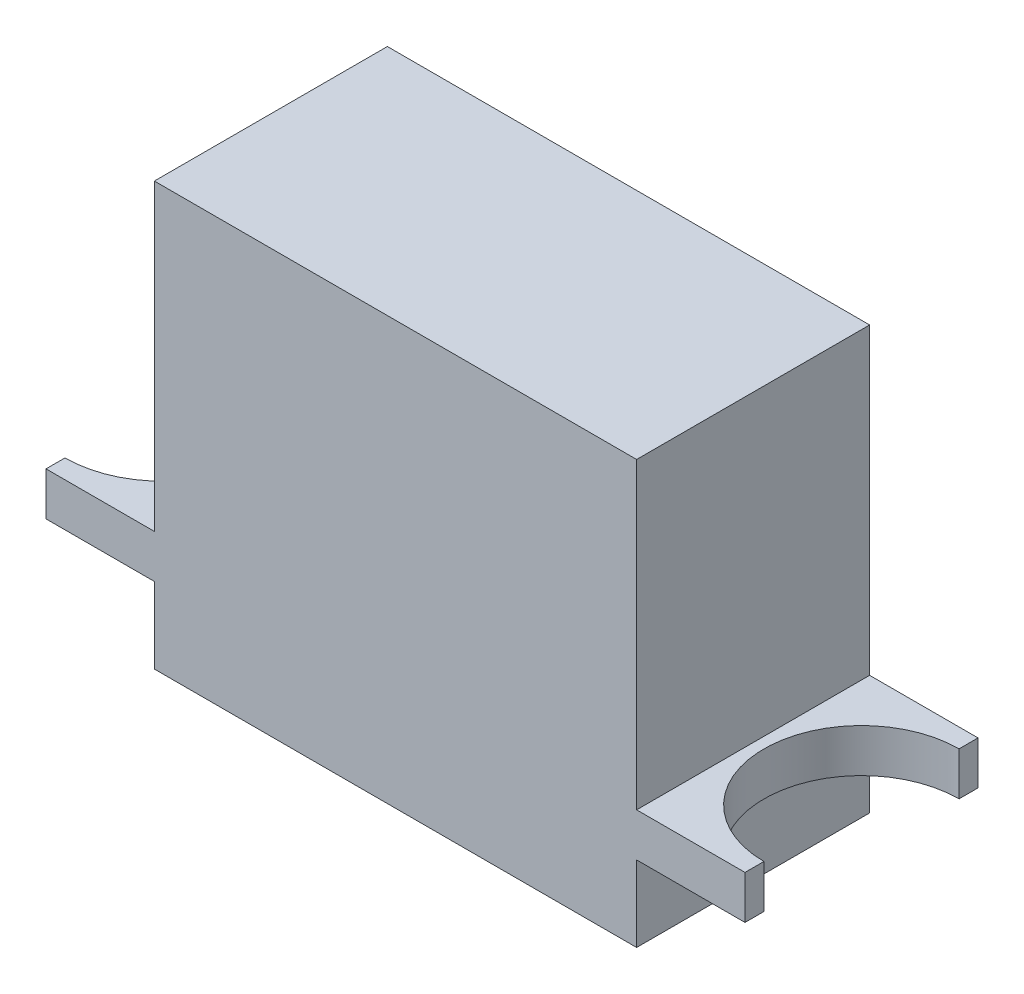
ISO-10303-21;
HEADER;
FILE_DESCRIPTION(('STEP AP214'),'2;1');
FILE_NAME('part.step','',(''),(''),'','','');
FILE_SCHEMA(('AUTOMOTIVE_DESIGN { 1 0 10303 214 1 1 1 1 }'));
ENDSEC;
DATA;
#1=APPLICATION_CONTEXT('core data for automotive mechanical design processes');
#2=APPLICATION_PROTOCOL_DEFINITION('international standard','automotive_design',2000,#1);
#3=PRODUCT_CONTEXT('',#1,'mechanical');
#4=PRODUCT('Part','Part','',(#3));
#5=PRODUCT_RELATED_PRODUCT_CATEGORY('part','',(#4));
#6=PRODUCT_DEFINITION_FORMATION('','',#4);
#7=PRODUCT_DEFINITION_CONTEXT('part definition',#1,'design');
#8=PRODUCT_DEFINITION('design','',#6,#7);
#9=PRODUCT_DEFINITION_SHAPE('','',#8);
#10=(LENGTH_UNIT() NAMED_UNIT(*) SI_UNIT(.MILLI.,.METRE.));
#11=(NAMED_UNIT(*) PLANE_ANGLE_UNIT() SI_UNIT($,.RADIAN.));
#12=(NAMED_UNIT(*) SI_UNIT($,.STERADIAN.) SOLID_ANGLE_UNIT());
#13=UNCERTAINTY_MEASURE_WITH_UNIT(LENGTH_MEASURE(1.E-05),#10,'distance_accuracy_value','');
#14=(GEOMETRIC_REPRESENTATION_CONTEXT(3) GLOBAL_UNCERTAINTY_ASSIGNED_CONTEXT((#13)) GLOBAL_UNIT_ASSIGNED_CONTEXT((#10,
#11,#12)) REPRESENTATION_CONTEXT('',''));
#15=CARTESIAN_POINT('',(0.,0.,0.));
#16=DIRECTION('',(0.,0.,1.));
#17=DIRECTION('',(1.,0.,0.));
#18=AXIS2_PLACEMENT_3D('',#15,#16,#17);
#19=CARTESIAN_POINT('',(-11.125,19.5,5.375));
#20=DIRECTION('',(-1.,0.,0.));
#21=DIRECTION('',(0.,0.,1.));
#22=AXIS2_PLACEMENT_3D('',#19,#20,#21);
#23=PLANE('',#22);
#24=DIRECTION('',(0.,-1.,0.));
#25=VECTOR('',#24,1.);
#26=CARTESIAN_POINT('',(-11.125,19.5,5.375));
#27=LINE('',#26,#25);
#28=CARTESIAN_POINT('',(-11.125,3.5,5.375));
#29=VERTEX_POINT('',#28);
#30=CARTESIAN_POINT('',(-11.125,0.,5.375));
#31=VERTEX_POINT('',#30);
#32=EDGE_CURVE('E48',#29,#31,#27,.T.);
#33=ORIENTED_EDGE('',*,*,#32,.F.);
#34=DIRECTION('',(0.,0.,-1.));
#35=VECTOR('',#34,1.);
#36=CARTESIAN_POINT('',(-11.125,3.5,5.375));
#37=LINE('',#36,#35);
#38=CARTESIAN_POINT('',(-11.125,3.5,-5.375));
#39=VERTEX_POINT('',#38);
#40=EDGE_CURVE('E230',#29,#39,#37,.T.);
#41=ORIENTED_EDGE('',*,*,#40,.T.);
#42=DIRECTION('',(0.,-1.,0.));
#43=VECTOR('',#42,1.);
#44=CARTESIAN_POINT('',(-11.125,19.5,-5.375));
#45=LINE('',#44,#43);
#46=CARTESIAN_POINT('',(-11.125,0.,-5.375));
#47=VERTEX_POINT('',#46);
#48=EDGE_CURVE('E244',#39,#47,#45,.T.);
#49=ORIENTED_EDGE('',*,*,#48,.T.);
#50=DIRECTION('',(0.,0.,-1.));
#51=VECTOR('',#50,1.);
#52=CARTESIAN_POINT('',(-11.125,0.,5.375));
#53=LINE('',#52,#51);
#54=EDGE_CURVE('E232',#31,#47,#53,.T.);
#55=ORIENTED_EDGE('',*,*,#54,.F.);
#56=EDGE_LOOP('',(#33,#41,#49,#55));
#57=FACE_BOUND('',#56,.T.);
#58=ADVANCED_FACE('F39',(#57),#23,.T.);
#59=CARTESIAN_POINT('',(11.125,19.5,5.375));
#60=DIRECTION('',(-1.,0.,0.));
#61=DIRECTION('',(0.,0.,1.));
#62=AXIS2_PLACEMENT_3D('',#59,#60,#61);
#63=PLANE('',#62);
#64=DIRECTION('',(0.,0.,-1.));
#65=VECTOR('',#64,1.);
#66=CARTESIAN_POINT('',(11.125,3.5,5.375));
#67=LINE('',#66,#65);
#68=CARTESIAN_POINT('',(11.125,3.5,5.375));
#69=VERTEX_POINT('',#68);
#70=CARTESIAN_POINT('',(11.125,3.5,-5.375));
#71=VERTEX_POINT('',#70);
#72=EDGE_CURVE('E228',#69,#71,#67,.T.);
#73=ORIENTED_EDGE('',*,*,#72,.F.);
#74=DIRECTION('',(0.,-1.,0.));
#75=VECTOR('',#74,1.);
#76=CARTESIAN_POINT('',(11.125,19.5,5.375));
#77=LINE('',#76,#75);
#78=CARTESIAN_POINT('',(11.125,0.,5.375));
#79=VERTEX_POINT('',#78);
#80=EDGE_CURVE('E257',#69,#79,#77,.T.);
#81=ORIENTED_EDGE('',*,*,#80,.T.);
#82=DIRECTION('',(0.,0.,-1.));
#83=VECTOR('',#82,1.);
#84=CARTESIAN_POINT('',(11.125,0.,5.375));
#85=LINE('',#84,#83);
#86=CARTESIAN_POINT('',(11.125,0.,-5.375));
#87=VERTEX_POINT('',#86);
#88=EDGE_CURVE('E250',#79,#87,#85,.T.);
#89=ORIENTED_EDGE('',*,*,#88,.T.);
#90=DIRECTION('',(0.,-1.,0.));
#91=VECTOR('',#90,1.);
#92=CARTESIAN_POINT('',(11.125,19.5,-5.375));
#93=LINE('',#92,#91);
#94=EDGE_CURVE('E260',#71,#87,#93,.T.);
#95=ORIENTED_EDGE('',*,*,#94,.F.);
#96=EDGE_LOOP('',(#73,#81,#89,#95));
#97=FACE_BOUND('',#96,.T.);
#98=ADVANCED_FACE('F302',(#97),#63,.F.);
#99=DIRECTION('',(0.,0.,-1.));
#100=VECTOR('',#99,1.);
#101=CARTESIAN_POINT('',(-11.125,5.5,5.375));
#102=LINE('',#101,#100);
#103=CARTESIAN_POINT('',(-11.125,5.5,5.375));
#104=VERTEX_POINT('',#103);
#105=CARTESIAN_POINT('',(-11.125,5.5,-5.375));
#106=VERTEX_POINT('',#105);
#107=EDGE_CURVE('E63',#104,#106,#102,.T.);
#108=ORIENTED_EDGE('',*,*,#107,.F.);
#109=CARTESIAN_POINT('',(-11.125,19.5,5.375));
#110=VERTEX_POINT('',#109);
#111=EDGE_CURVE('E11',#110,#104,#27,.T.);
#112=ORIENTED_EDGE('',*,*,#111,.F.);
#113=DIRECTION('',(0.,0.,-1.));
#114=VECTOR('',#113,1.);
#115=CARTESIAN_POINT('',(-11.125,19.5,5.375));
#116=LINE('',#115,#114);
#117=CARTESIAN_POINT('',(-11.125,19.5,-5.375));
#118=VERTEX_POINT('',#117);
#119=EDGE_CURVE('E233',#110,#118,#116,.T.);
#120=ORIENTED_EDGE('',*,*,#119,.T.);
#121=EDGE_CURVE('E43',#118,#106,#45,.T.);
#122=ORIENTED_EDGE('',*,*,#121,.T.);
#123=EDGE_LOOP('',(#108,#112,#120,#122));
#124=FACE_BOUND('',#123,.T.);
#125=ADVANCED_FACE('F41',(#124),#23,.T.);
#126=CARTESIAN_POINT('',(-11.125,19.5,5.375));
#127=DIRECTION('',(0.,0.,-1.));
#128=DIRECTION('',(-1.,0.,0.));
#129=AXIS2_PLACEMENT_3D('',#126,#127,#128);
#130=PLANE('',#129);
#131=ORIENTED_EDGE('',*,*,#111,.T.);
#132=DIRECTION('',(-1.,0.,0.));
#133=VECTOR('',#132,1.);
#134=CARTESIAN_POINT('',(0.,5.5,5.375));
#135=LINE('',#134,#133);
#136=CARTESIAN_POINT('',(-16.125,5.5,5.375));
#137=VERTEX_POINT('',#136);
#138=EDGE_CURVE('E207',#104,#137,#135,.T.);
#139=ORIENTED_EDGE('',*,*,#138,.T.);
#140=DIRECTION('',(0.,1.,0.));
#141=VECTOR('',#140,1.);
#142=CARTESIAN_POINT('',(-16.125,3.5,5.375));
#143=LINE('',#142,#141);
#144=CARTESIAN_POINT('',(-16.125,3.5,5.375));
#145=VERTEX_POINT('',#144);
#146=EDGE_CURVE('E212',#145,#137,#143,.T.);
#147=ORIENTED_EDGE('',*,*,#146,.F.);
#148=DIRECTION('',(-1.,0.,0.));
#149=VECTOR('',#148,1.);
#150=CARTESIAN_POINT('',(0.,3.5,5.375));
#151=LINE('',#150,#149);
#152=EDGE_CURVE('E183',#29,#145,#151,.T.);
#153=ORIENTED_EDGE('',*,*,#152,.F.);
#154=ORIENTED_EDGE('',*,*,#32,.T.);
#155=DIRECTION('',(1.,0.,0.));
#156=VECTOR('',#155,1.);
#157=CARTESIAN_POINT('',(-11.125,0.,5.375));
#158=LINE('',#157,#156);
#159=EDGE_CURVE('E237',#31,#79,#158,.T.);
#160=ORIENTED_EDGE('',*,*,#159,.T.);
#161=ORIENTED_EDGE('',*,*,#80,.F.);
#162=CARTESIAN_POINT('',(16.125,3.5,5.375));
#163=VERTEX_POINT('',#162);
#164=EDGE_CURVE('E181',#163,#69,#151,.T.);
#165=ORIENTED_EDGE('',*,*,#164,.F.);
#166=DIRECTION('',(0.,1.,0.));
#167=VECTOR('',#166,1.);
#168=CARTESIAN_POINT('',(16.125,3.5,5.375));
#169=LINE('',#168,#167);
#170=CARTESIAN_POINT('',(16.125,5.5,5.375));
#171=VERTEX_POINT('',#170);
#172=EDGE_CURVE('E210',#163,#171,#169,.T.);
#173=ORIENTED_EDGE('',*,*,#172,.T.);
#174=CARTESIAN_POINT('',(11.125,5.5,5.375));
#175=VERTEX_POINT('',#174);
#176=EDGE_CURVE('E204',#171,#175,#135,.T.);
#177=ORIENTED_EDGE('',*,*,#176,.T.);
#178=CARTESIAN_POINT('',(11.125,19.5,5.375));
#179=VERTEX_POINT('',#178);
#180=EDGE_CURVE('E255',#179,#175,#77,.T.);
#181=ORIENTED_EDGE('',*,*,#180,.F.);
#182=DIRECTION('',(1.,0.,0.));
#183=VECTOR('',#182,1.);
#184=CARTESIAN_POINT('',(-11.125,19.5,5.375));
#185=LINE('',#184,#183);
#186=EDGE_CURVE('E242',#110,#179,#185,.T.);
#187=ORIENTED_EDGE('',*,*,#186,.F.);
#188=EDGE_LOOP('',(#131,#139,#147,#153,#154,#160,#161,#165,#173,#177,#181,#187));
#189=FACE_BOUND('',#188,.T.);
#190=ADVANCED_FACE('F275',(#189),#130,.F.);
#191=ORIENTED_EDGE('',*,*,#180,.T.);
#192=DIRECTION('',(0.,0.,-1.));
#193=VECTOR('',#192,1.);
#194=CARTESIAN_POINT('',(11.125,5.5,5.375));
#195=LINE('',#194,#193);
#196=CARTESIAN_POINT('',(11.125,5.5,-5.375));
#197=VERTEX_POINT('',#196);
#198=EDGE_CURVE('E209',#175,#197,#195,.T.);
#199=ORIENTED_EDGE('',*,*,#198,.T.);
#200=CARTESIAN_POINT('',(11.125,19.5,-5.375));
#201=VERTEX_POINT('',#200);
#202=EDGE_CURVE('E258',#201,#197,#93,.T.);
#203=ORIENTED_EDGE('',*,*,#202,.F.);
#204=DIRECTION('',(0.,0.,-1.));
#205=VECTOR('',#204,1.);
#206=CARTESIAN_POINT('',(11.125,19.5,5.375));
#207=LINE('',#206,#205);
#208=EDGE_CURVE('E240',#179,#201,#207,.T.);
#209=ORIENTED_EDGE('',*,*,#208,.F.);
#210=EDGE_LOOP('',(#191,#199,#203,#209));
#211=FACE_BOUND('',#210,.T.);
#212=ADVANCED_FACE('F305',(#211),#63,.F.);
#213=CARTESIAN_POINT('',(-11.125,19.5,-5.375));
#214=DIRECTION('',(0.,0.,-1.));
#215=DIRECTION('',(-1.,0.,0.));
#216=AXIS2_PLACEMENT_3D('',#213,#214,#215);
#217=PLANE('',#216);
#218=ORIENTED_EDGE('',*,*,#202,.T.);
#219=DIRECTION('',(-1.,0.,0.));
#220=VECTOR('',#219,1.);
#221=CARTESIAN_POINT('',(0.,5.5,-5.375));
#222=LINE('',#221,#220);
#223=CARTESIAN_POINT('',(16.125,5.5,-5.375));
#224=VERTEX_POINT('',#223);
#225=EDGE_CURVE('E196',#224,#197,#222,.T.);
#226=ORIENTED_EDGE('',*,*,#225,.F.);
#227=DIRECTION('',(0.,1.,0.));
#228=VECTOR('',#227,1.);
#229=CARTESIAN_POINT('',(16.125,3.5,-5.375));
#230=LINE('',#229,#228);
#231=CARTESIAN_POINT('',(16.125,3.5,-5.375));
#232=VERTEX_POINT('',#231);
#233=EDGE_CURVE('E162',#232,#224,#230,.T.);
#234=ORIENTED_EDGE('',*,*,#233,.F.);
#235=DIRECTION('',(-1.,0.,0.));
#236=VECTOR('',#235,1.);
#237=CARTESIAN_POINT('',(0.,3.5,-5.375));
#238=LINE('',#237,#236);
#239=EDGE_CURVE('E177',#232,#71,#238,.T.);
#240=ORIENTED_EDGE('',*,*,#239,.T.);
#241=ORIENTED_EDGE('',*,*,#94,.T.);
#242=DIRECTION('',(1.,0.,0.));
#243=VECTOR('',#242,1.);
#244=CARTESIAN_POINT('',(-11.125,0.,-5.375));
#245=LINE('',#244,#243);
#246=EDGE_CURVE('E247',#47,#87,#245,.T.);
#247=ORIENTED_EDGE('',*,*,#246,.F.);
#248=ORIENTED_EDGE('',*,*,#48,.F.);
#249=CARTESIAN_POINT('',(-16.125,3.5,-5.375));
#250=VERTEX_POINT('',#249);
#251=EDGE_CURVE('E178',#39,#250,#238,.T.);
#252=ORIENTED_EDGE('',*,*,#251,.T.);
#253=DIRECTION('',(0.,1.,0.));
#254=VECTOR('',#253,1.);
#255=CARTESIAN_POINT('',(-16.125,3.5,-5.375));
#256=LINE('',#255,#254);
#257=CARTESIAN_POINT('',(-16.125,5.5,-5.375));
#258=VERTEX_POINT('',#257);
#259=EDGE_CURVE('E221',#250,#258,#256,.T.);
#260=ORIENTED_EDGE('',*,*,#259,.T.);
#261=EDGE_CURVE('E195',#106,#258,#222,.T.);
#262=ORIENTED_EDGE('',*,*,#261,.F.);
#263=ORIENTED_EDGE('',*,*,#121,.F.);
#264=DIRECTION('',(1.,0.,0.));
#265=VECTOR('',#264,1.);
#266=CARTESIAN_POINT('',(-11.125,19.5,-5.375));
#267=LINE('',#266,#265);
#268=EDGE_CURVE('E236',#118,#201,#267,.T.);
#269=ORIENTED_EDGE('',*,*,#268,.T.);
#270=EDGE_LOOP('',(#218,#226,#234,#240,#241,#247,#248,#252,#260,#262,#263,#269));
#271=FACE_BOUND('',#270,.T.);
#272=ADVANCED_FACE('F268',(#271),#217,.T.);
#273=CARTESIAN_POINT('',(0.,19.5,0.));
#274=DIRECTION('',(0.,-1.,0.));
#275=DIRECTION('',(0.,0.,-1.));
#276=AXIS2_PLACEMENT_3D('',#273,#274,#275);
#277=PLANE('',#276);
#278=ORIENTED_EDGE('',*,*,#119,.F.);
#279=ORIENTED_EDGE('',*,*,#186,.T.);
#280=ORIENTED_EDGE('',*,*,#208,.T.);
#281=ORIENTED_EDGE('',*,*,#268,.F.);
#282=EDGE_LOOP('',(#278,#279,#280,#281));
#283=FACE_BOUND('',#282,.T.);
#284=ADVANCED_FACE('F317',(#283),#277,.F.);
#285=CARTESIAN_POINT('',(0.,0.,0.));
#286=DIRECTION('',(0.,-1.,0.));
#287=DIRECTION('',(0.,0.,-1.));
#288=AXIS2_PLACEMENT_3D('',#285,#286,#287);
#289=PLANE('',#288);
#290=ORIENTED_EDGE('',*,*,#54,.T.);
#291=ORIENTED_EDGE('',*,*,#246,.T.);
#292=ORIENTED_EDGE('',*,*,#88,.F.);
#293=ORIENTED_EDGE('',*,*,#159,.F.);
#294=EDGE_LOOP('',(#290,#291,#292,#293));
#295=FACE_BOUND('',#294,.T.);
#296=ADVANCED_FACE('F272',(#295),#289,.T.);
#297=CARTESIAN_POINT('',(16.125,3.5,0.));
#298=DIRECTION('',(1.,0.,0.));
#299=DIRECTION('',(0.,0.,-1.));
#300=AXIS2_PLACEMENT_3D('',#297,#298,#299);
#301=PLANE('',#300);
#302=DIRECTION('',(0.,0.,-1.));
#303=VECTOR('',#302,1.);
#304=CARTESIAN_POINT('',(16.125,5.5,0.));
#305=LINE('',#304,#303);
#306=CARTESIAN_POINT('',(16.125,5.5,-4.5));
#307=VERTEX_POINT('',#306);
#308=EDGE_CURVE('E158',#307,#224,#305,.T.);
#309=ORIENTED_EDGE('',*,*,#308,.F.);
#310=DIRECTION('',(0.,1.,0.));
#311=VECTOR('',#310,1.);
#312=CARTESIAN_POINT('',(16.125,3.5,-4.5));
#313=LINE('',#312,#311);
#314=CARTESIAN_POINT('',(16.125,3.5,-4.5));
#315=VERTEX_POINT('',#314);
#316=EDGE_CURVE('E152',#315,#307,#313,.T.);
#317=ORIENTED_EDGE('',*,*,#316,.F.);
#318=DIRECTION('',(0.,0.,-1.));
#319=VECTOR('',#318,1.);
#320=CARTESIAN_POINT('',(16.125,3.5,0.));
#321=LINE('',#320,#319);
#322=EDGE_CURVE('E156',#315,#232,#321,.T.);
#323=ORIENTED_EDGE('',*,*,#322,.T.);
#324=ORIENTED_EDGE('',*,*,#233,.T.);
#325=EDGE_LOOP('',(#309,#317,#323,#324));
#326=FACE_BOUND('',#325,.T.);
#327=ADVANCED_FACE('F154',(#326),#301,.T.);
#328=CARTESIAN_POINT('',(16.125,3.5,0.));
#329=DIRECTION('',(0.,1.,0.));
#330=DIRECTION('',(0.,0.,1.));
#331=AXIS2_PLACEMENT_3D('',#328,#329,#330);
#332=CYLINDRICAL_SURFACE('',#331,4.5);
#333=CARTESIAN_POINT('',(16.125,5.5,0.));
#334=DIRECTION('',(0.,1.,0.));
#335=DIRECTION('',(0.,0.,1.));
#336=AXIS2_PLACEMENT_3D('',#333,#334,#335);
#337=CIRCLE('',#336,4.5);
#338=CARTESIAN_POINT('',(16.125,5.5,4.5));
#339=VERTEX_POINT('',#338);
#340=EDGE_CURVE('E192',#307,#339,#337,.T.);
#341=ORIENTED_EDGE('',*,*,#340,.T.);
#342=DIRECTION('',(0.,1.,0.));
#343=VECTOR('',#342,1.);
#344=CARTESIAN_POINT('',(16.125,3.5,4.5));
#345=LINE('',#344,#343);
#346=CARTESIAN_POINT('',(16.125,3.5,4.5));
#347=VERTEX_POINT('',#346);
#348=EDGE_CURVE('E168',#347,#339,#345,.T.);
#349=ORIENTED_EDGE('',*,*,#348,.F.);
#350=CARTESIAN_POINT('',(16.125,3.5,0.));
#351=DIRECTION('',(0.,1.,0.));
#352=DIRECTION('',(0.,0.,1.));
#353=AXIS2_PLACEMENT_3D('',#350,#351,#352);
#354=CIRCLE('',#353,4.5);
#355=EDGE_CURVE('E166',#315,#347,#354,.T.);
#356=ORIENTED_EDGE('',*,*,#355,.F.);
#357=ORIENTED_EDGE('',*,*,#316,.T.);
#358=EDGE_LOOP('',(#341,#349,#356,#357));
#359=FACE_BOUND('',#358,.T.);
#360=ADVANCED_FACE('F167',(#359),#332,.F.);
#361=EDGE_CURVE('E172',#171,#339,#305,.T.);
#362=ORIENTED_EDGE('',*,*,#361,.F.);
#363=ORIENTED_EDGE('',*,*,#172,.F.);
#364=EDGE_CURVE('E163',#163,#347,#321,.T.);
#365=ORIENTED_EDGE('',*,*,#364,.T.);
#366=ORIENTED_EDGE('',*,*,#348,.T.);
#367=EDGE_LOOP('',(#362,#363,#365,#366));
#368=FACE_BOUND('',#367,.T.);
#369=ADVANCED_FACE('F327',(#368),#301,.T.);
#370=CARTESIAN_POINT('',(0.,3.5,0.));
#371=DIRECTION('',(0.,1.,0.));
#372=DIRECTION('',(0.,0.,1.));
#373=AXIS2_PLACEMENT_3D('',#370,#371,#372);
#374=PLANE('',#373);
#375=ORIENTED_EDGE('',*,*,#164,.T.);
#376=ORIENTED_EDGE('',*,*,#72,.T.);
#377=ORIENTED_EDGE('',*,*,#239,.F.);
#378=ORIENTED_EDGE('',*,*,#322,.F.);
#379=ORIENTED_EDGE('',*,*,#355,.T.);
#380=ORIENTED_EDGE('',*,*,#364,.F.);
#381=EDGE_LOOP('',(#375,#376,#377,#378,#379,#380));
#382=FACE_BOUND('',#381,.T.);
#383=ADVANCED_FACE('F175',(#382),#374,.F.);
#384=CARTESIAN_POINT('',(0.,5.5,0.));
#385=DIRECTION('',(0.,1.,0.));
#386=DIRECTION('',(0.,0.,1.));
#387=AXIS2_PLACEMENT_3D('',#384,#385,#386);
#388=PLANE('',#387);
#389=ORIENTED_EDGE('',*,*,#198,.F.);
#390=ORIENTED_EDGE('',*,*,#176,.F.);
#391=ORIENTED_EDGE('',*,*,#361,.T.);
#392=ORIENTED_EDGE('',*,*,#340,.F.);
#393=ORIENTED_EDGE('',*,*,#308,.T.);
#394=ORIENTED_EDGE('',*,*,#225,.T.);
#395=EDGE_LOOP('',(#389,#390,#391,#392,#393,#394));
#396=FACE_BOUND('',#395,.T.);
#397=ADVANCED_FACE('F326',(#396),#388,.T.);
#398=CARTESIAN_POINT('',(-16.125,3.5,0.));
#399=DIRECTION('',(1.,0.,0.));
#400=DIRECTION('',(0.,0.,-1.));
#401=AXIS2_PLACEMENT_3D('',#398,#399,#400);
#402=PLANE('',#401);
#403=DIRECTION('',(0.,0.,-1.));
#404=VECTOR('',#403,1.);
#405=CARTESIAN_POINT('',(-16.125,5.5,0.));
#406=LINE('',#405,#404);
#407=CARTESIAN_POINT('',(-16.125,5.5,4.5));
#408=VERTEX_POINT('',#407);
#409=EDGE_CURVE('E202',#137,#408,#406,.T.);
#410=ORIENTED_EDGE('',*,*,#409,.T.);
#411=DIRECTION('',(0.,1.,0.));
#412=VECTOR('',#411,1.);
#413=CARTESIAN_POINT('',(-16.125,3.5,4.5));
#414=LINE('',#413,#412);
#415=CARTESIAN_POINT('',(-16.125,3.5,4.5));
#416=VERTEX_POINT('',#415);
#417=EDGE_CURVE('E215',#416,#408,#414,.T.);
#418=ORIENTED_EDGE('',*,*,#417,.F.);
#419=DIRECTION('',(0.,0.,-1.));
#420=VECTOR('',#419,1.);
#421=CARTESIAN_POINT('',(-16.125,3.5,0.));
#422=LINE('',#421,#420);
#423=EDGE_CURVE('E187',#145,#416,#422,.T.);
#424=ORIENTED_EDGE('',*,*,#423,.F.);
#425=ORIENTED_EDGE('',*,*,#146,.T.);
#426=EDGE_LOOP('',(#410,#418,#424,#425));
#427=FACE_BOUND('',#426,.T.);
#428=ADVANCED_FACE('F297',(#427),#402,.F.);
#429=CARTESIAN_POINT('',(-16.125,3.5,0.));
#430=DIRECTION('',(0.,1.,0.));
#431=DIRECTION('',(0.,0.,1.));
#432=AXIS2_PLACEMENT_3D('',#429,#430,#431);
#433=CYLINDRICAL_SURFACE('',#432,4.5);
#434=CARTESIAN_POINT('',(-16.125,5.5,0.));
#435=DIRECTION('',(0.,1.,0.));
#436=DIRECTION('',(0.,0.,1.));
#437=AXIS2_PLACEMENT_3D('',#434,#435,#436);
#438=CIRCLE('',#437,4.5);
#439=CARTESIAN_POINT('',(-16.125,5.5,-4.5));
#440=VERTEX_POINT('',#439);
#441=EDGE_CURVE('E201',#408,#440,#438,.T.);
#442=ORIENTED_EDGE('',*,*,#441,.T.);
#443=DIRECTION('',(0.,1.,0.));
#444=VECTOR('',#443,1.);
#445=CARTESIAN_POINT('',(-16.125,3.5,-4.5));
#446=LINE('',#445,#444);
#447=CARTESIAN_POINT('',(-16.125,3.5,-4.5));
#448=VERTEX_POINT('',#447);
#449=EDGE_CURVE('E218',#448,#440,#446,.T.);
#450=ORIENTED_EDGE('',*,*,#449,.F.);
#451=CARTESIAN_POINT('',(-16.125,3.5,0.));
#452=DIRECTION('',(0.,1.,0.));
#453=DIRECTION('',(0.,0.,1.));
#454=AXIS2_PLACEMENT_3D('',#451,#452,#453);
#455=CIRCLE('',#454,4.5);
#456=EDGE_CURVE('E190',#416,#448,#455,.T.);
#457=ORIENTED_EDGE('',*,*,#456,.F.);
#458=ORIENTED_EDGE('',*,*,#417,.T.);
#459=EDGE_LOOP('',(#442,#450,#457,#458));
#460=FACE_BOUND('',#459,.T.);
#461=ADVANCED_FACE('F300',(#460),#433,.F.);
#462=EDGE_CURVE('E198',#440,#258,#406,.T.);
#463=ORIENTED_EDGE('',*,*,#462,.T.);
#464=ORIENTED_EDGE('',*,*,#259,.F.);
#465=EDGE_CURVE('E284',#448,#250,#422,.T.);
#466=ORIENTED_EDGE('',*,*,#465,.F.);
#467=ORIENTED_EDGE('',*,*,#449,.T.);
#468=EDGE_LOOP('',(#463,#464,#466,#467));
#469=FACE_BOUND('',#468,.T.);
#470=ADVANCED_FACE('F289',(#469),#402,.F.);
#471=ORIENTED_EDGE('',*,*,#40,.F.);
#472=ORIENTED_EDGE('',*,*,#152,.T.);
#473=ORIENTED_EDGE('',*,*,#423,.T.);
#474=ORIENTED_EDGE('',*,*,#456,.T.);
#475=ORIENTED_EDGE('',*,*,#465,.T.);
#476=ORIENTED_EDGE('',*,*,#251,.F.);
#477=EDGE_LOOP('',(#471,#472,#473,#474,#475,#476));
#478=FACE_BOUND('',#477,.T.);
#479=ADVANCED_FACE('F280',(#478),#374,.F.);
#480=ORIENTED_EDGE('',*,*,#138,.F.);
#481=ORIENTED_EDGE('',*,*,#107,.T.);
#482=ORIENTED_EDGE('',*,*,#261,.T.);
#483=ORIENTED_EDGE('',*,*,#462,.F.);
#484=ORIENTED_EDGE('',*,*,#441,.F.);
#485=ORIENTED_EDGE('',*,*,#409,.F.);
#486=EDGE_LOOP('',(#480,#481,#482,#483,#484,#485));
#487=FACE_BOUND('',#486,.T.);
#488=ADVANCED_FACE('F294',(#487),#388,.T.);
#489=CLOSED_SHELL('',(#58,#98,#125,#190,#212,#272,#284,#296,#327,#360,#369,#383,#397,#428,#461,
#470,#479,#488));
#490=MANIFOLD_SOLID_BREP('B2',#489);
#491=ADVANCED_BREP_SHAPE_REPRESENTATION('',(#18,#490),#14);
#492=SHAPE_DEFINITION_REPRESENTATION(#9,#491);
ENDSEC;
END-ISO-10303-21;
